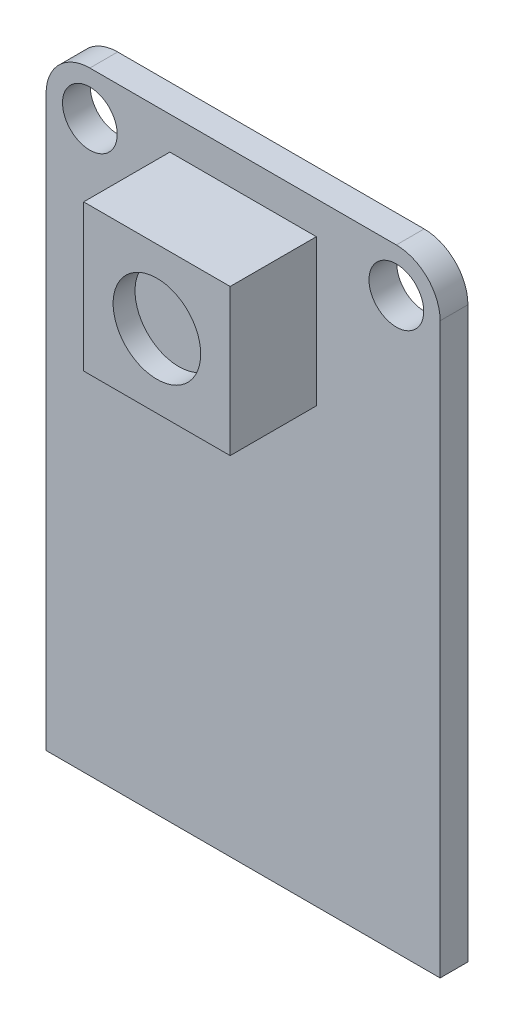
ISO-10303-21;
HEADER;
FILE_DESCRIPTION(('STEP AP214'),'2;1');
FILE_NAME('part.step','',(''),(''),'','','');
FILE_SCHEMA(('AUTOMOTIVE_DESIGN { 1 0 10303 214 1 1 1 1 }'));
ENDSEC;
DATA;
#1=APPLICATION_CONTEXT('core data for automotive mechanical design processes');
#2=APPLICATION_PROTOCOL_DEFINITION('international standard','automotive_design',2000,#1);
#3=PRODUCT_CONTEXT('',#1,'mechanical');
#4=PRODUCT('Part','Part','',(#3));
#5=PRODUCT_RELATED_PRODUCT_CATEGORY('part','',(#4));
#6=PRODUCT_DEFINITION_FORMATION('','',#4);
#7=PRODUCT_DEFINITION_CONTEXT('part definition',#1,'design');
#8=PRODUCT_DEFINITION('design','',#6,#7);
#9=PRODUCT_DEFINITION_SHAPE('','',#8);
#10=(LENGTH_UNIT() NAMED_UNIT(*) SI_UNIT(.MILLI.,.METRE.));
#11=(NAMED_UNIT(*) PLANE_ANGLE_UNIT() SI_UNIT($,.RADIAN.));
#12=(NAMED_UNIT(*) SI_UNIT($,.STERADIAN.) SOLID_ANGLE_UNIT());
#13=UNCERTAINTY_MEASURE_WITH_UNIT(LENGTH_MEASURE(1.E-05),#10,'distance_accuracy_value','');
#14=(GEOMETRIC_REPRESENTATION_CONTEXT(3) GLOBAL_UNCERTAINTY_ASSIGNED_CONTEXT((#13)) GLOBAL_UNIT_ASSIGNED_CONTEXT((#10,
#11,#12)) REPRESENTATION_CONTEXT('',''));
#15=CARTESIAN_POINT('',(0.,0.,0.));
#16=DIRECTION('',(0.,0.,1.));
#17=DIRECTION('',(1.,0.,0.));
#18=AXIS2_PLACEMENT_3D('',#15,#16,#17);
#19=CARTESIAN_POINT('',(0.,0.,1.6129));
#20=DIRECTION('',(0.,0.,-1.));
#21=DIRECTION('',(-1.,0.,0.));
#22=AXIS2_PLACEMENT_3D('',#19,#20,#21);
#23=PLANE('',#22);
#24=CARTESIAN_POINT('',(-8.89,15.24,1.6129));
#25=DIRECTION('',(0.,0.,1.));
#26=DIRECTION('',(1.,0.,0.));
#27=AXIS2_PLACEMENT_3D('',#24,#25,#26);
#28=CIRCLE('',#27,1.5875);
#29=CARTESIAN_POINT('',(-7.3025,15.24,1.6129));
#30=VERTEX_POINT('',#29);
#31=EDGE_CURVE('E390',#30,#30,#28,.T.);
#32=ORIENTED_EDGE('',*,*,#31,.F.);
#33=EDGE_LOOP('',(#32));
#34=FACE_BOUND('',#33,.T.);
#35=CARTESIAN_POINT('',(8.89,15.24,1.6129));
#36=DIRECTION('',(0.,0.,1.));
#37=DIRECTION('',(1.,0.,0.));
#38=AXIS2_PLACEMENT_3D('',#35,#36,#37);
#39=CIRCLE('',#38,1.5875);
#40=CARTESIAN_POINT('',(10.4775,15.24,1.6129));
#41=VERTEX_POINT('',#40);
#42=EDGE_CURVE('E379',#41,#41,#39,.T.);
#43=ORIENTED_EDGE('',*,*,#42,.F.);
#44=EDGE_LOOP('',(#43));
#45=FACE_BOUND('',#44,.T.);
#46=DIRECTION('',(0.,1.,0.));
#47=VECTOR('',#46,1.);
#48=CARTESIAN_POINT('',(11.43,-17.78,1.6129));
#49=LINE('',#48,#47);
#50=CARTESIAN_POINT('',(11.43,-17.78,1.6129));
#51=VERTEX_POINT('',#50);
#52=CARTESIAN_POINT('',(11.43,15.24,1.6129));
#53=VERTEX_POINT('',#52);
#54=EDGE_CURVE('E157',#51,#53,#49,.T.);
#55=ORIENTED_EDGE('',*,*,#54,.T.);
#56=CARTESIAN_POINT('',(8.89,15.24,1.6129));
#57=DIRECTION('',(0.,0.,-1.));
#58=DIRECTION('',(-1.,0.,0.));
#59=AXIS2_PLACEMENT_3D('',#56,#57,#58);
#60=CIRCLE('',#59,2.54);
#61=CARTESIAN_POINT('',(8.89,17.78,1.6129));
#62=VERTEX_POINT('',#61);
#63=EDGE_CURVE('E53',#53,#62,#60,.F.);
#64=ORIENTED_EDGE('',*,*,#63,.T.);
#65=DIRECTION('',(-1.,0.,0.));
#66=VECTOR('',#65,1.);
#67=CARTESIAN_POINT('',(-11.43,17.78,1.6129));
#68=LINE('',#67,#66);
#69=CARTESIAN_POINT('',(-8.89,17.78,1.6129));
#70=VERTEX_POINT('',#69);
#71=EDGE_CURVE('E161',#62,#70,#68,.T.);
#72=ORIENTED_EDGE('',*,*,#71,.T.);
#73=CARTESIAN_POINT('',(-8.89,15.24,1.6129));
#74=DIRECTION('',(0.,0.,-1.));
#75=DIRECTION('',(-1.,0.,0.));
#76=AXIS2_PLACEMENT_3D('',#73,#74,#75);
#77=CIRCLE('',#76,2.54);
#78=CARTESIAN_POINT('',(-11.43,15.24,1.6129));
#79=VERTEX_POINT('',#78);
#80=EDGE_CURVE('E204',#70,#79,#77,.F.);
#81=ORIENTED_EDGE('',*,*,#80,.T.);
#82=DIRECTION('',(0.,-1.,0.));
#83=VECTOR('',#82,1.);
#84=CARTESIAN_POINT('',(-11.43,-17.78,1.6129));
#85=LINE('',#84,#83);
#86=CARTESIAN_POINT('',(-11.43,-17.78,1.6129));
#87=VERTEX_POINT('',#86);
#88=EDGE_CURVE('E166',#79,#87,#85,.T.);
#89=ORIENTED_EDGE('',*,*,#88,.T.);
#90=DIRECTION('',(1.,0.,0.));
#91=VECTOR('',#90,1.);
#92=CARTESIAN_POINT('',(-11.43,-17.78,1.6129));
#93=LINE('',#92,#91);
#94=EDGE_CURVE('E169',#87,#51,#93,.T.);
#95=ORIENTED_EDGE('',*,*,#94,.T.);
#96=EDGE_LOOP('',(#55,#64,#72,#81,#89,#95));
#97=FACE_BOUND('',#96,.T.);
#98=DIRECTION('',(0.,-1.,0.));
#99=VECTOR('',#98,1.);
#100=CARTESIAN_POINT('',(-4.25,15.875,1.6129));
#101=LINE('',#100,#99);
#102=CARTESIAN_POINT('',(-4.25,15.875,1.6129));
#103=VERTEX_POINT('',#102);
#104=CARTESIAN_POINT('',(-4.25,7.375,1.6129));
#105=VERTEX_POINT('',#104);
#106=EDGE_CURVE('E144',#103,#105,#101,.T.);
#107=ORIENTED_EDGE('',*,*,#106,.F.);
#108=DIRECTION('',(-1.,0.,0.));
#109=VECTOR('',#108,1.);
#110=CARTESIAN_POINT('',(-4.25,15.875,1.6129));
#111=LINE('',#110,#109);
#112=CARTESIAN_POINT('',(4.25,15.875,1.6129));
#113=VERTEX_POINT('',#112);
#114=EDGE_CURVE('E141',#113,#103,#111,.T.);
#115=ORIENTED_EDGE('',*,*,#114,.F.);
#116=DIRECTION('',(0.,1.,0.));
#117=VECTOR('',#116,1.);
#118=CARTESIAN_POINT('',(4.25,15.875,1.6129));
#119=LINE('',#118,#117);
#120=CARTESIAN_POINT('',(4.25,7.375,1.6129));
#121=VERTEX_POINT('',#120);
#122=EDGE_CURVE('E65',#121,#113,#119,.T.);
#123=ORIENTED_EDGE('',*,*,#122,.F.);
#124=DIRECTION('',(1.,0.,0.));
#125=VECTOR('',#124,1.);
#126=CARTESIAN_POINT('',(-4.25,7.375,1.6129));
#127=LINE('',#126,#125);
#128=EDGE_CURVE('E60',#105,#121,#127,.T.);
#129=ORIENTED_EDGE('',*,*,#128,.F.);
#130=EDGE_LOOP('',(#107,#115,#123,#129));
#131=FACE_BOUND('',#130,.T.);
#132=ADVANCED_FACE('F44',(#34,#45,#97,#131),#23,.F.);
#133=CARTESIAN_POINT('',(11.43,-17.78,1.6129));
#134=DIRECTION('',(-1.,0.,0.));
#135=DIRECTION('',(0.,0.,1.));
#136=AXIS2_PLACEMENT_3D('',#133,#134,#135);
#137=PLANE('',#136);
#138=DIRECTION('',(0.,1.,0.));
#139=VECTOR('',#138,1.);
#140=CARTESIAN_POINT('',(11.43,-17.78,0.));
#141=LINE('',#140,#139);
#142=CARTESIAN_POINT('',(11.43,-17.78,0.));
#143=VERTEX_POINT('',#142);
#144=CARTESIAN_POINT('',(11.43,15.24,0.));
#145=VERTEX_POINT('',#144);
#146=EDGE_CURVE('E146',#143,#145,#141,.T.);
#147=ORIENTED_EDGE('',*,*,#146,.T.);
#148=DIRECTION('',(0.,0.,-1.));
#149=VECTOR('',#148,1.);
#150=CARTESIAN_POINT('',(11.43,15.24,1.6129));
#151=LINE('',#150,#149);
#152=EDGE_CURVE('E201',#145,#53,#151,.F.);
#153=ORIENTED_EDGE('',*,*,#152,.T.);
#154=ORIENTED_EDGE('',*,*,#54,.F.);
#155=DIRECTION('',(0.,0.,-1.));
#156=VECTOR('',#155,1.);
#157=CARTESIAN_POINT('',(11.43,-17.78,1.6129));
#158=LINE('',#157,#156);
#159=EDGE_CURVE('E171',#51,#143,#158,.T.);
#160=ORIENTED_EDGE('',*,*,#159,.T.);
#161=EDGE_LOOP('',(#147,#153,#154,#160));
#162=FACE_BOUND('',#161,.T.);
#163=ADVANCED_FACE('F225',(#162),#137,.F.);
#164=CARTESIAN_POINT('',(-11.43,17.78,1.6129));
#165=DIRECTION('',(0.,-1.,0.));
#166=DIRECTION('',(0.,0.,-1.));
#167=AXIS2_PLACEMENT_3D('',#164,#165,#166);
#168=PLANE('',#167);
#169=ORIENTED_EDGE('',*,*,#71,.F.);
#170=DIRECTION('',(0.,0.,-1.));
#171=VECTOR('',#170,1.);
#172=CARTESIAN_POINT('',(8.89,17.78,1.6129));
#173=LINE('',#172,#171);
#174=CARTESIAN_POINT('',(8.89,17.78,0.));
#175=VERTEX_POINT('',#174);
#176=EDGE_CURVE('E191',#62,#175,#173,.T.);
#177=ORIENTED_EDGE('',*,*,#176,.T.);
#178=DIRECTION('',(-1.,0.,0.));
#179=VECTOR('',#178,1.);
#180=CARTESIAN_POINT('',(-11.43,17.78,0.));
#181=LINE('',#180,#179);
#182=CARTESIAN_POINT('',(-8.89,17.78,0.));
#183=VERTEX_POINT('',#182);
#184=EDGE_CURVE('E151',#175,#183,#181,.T.);
#185=ORIENTED_EDGE('',*,*,#184,.T.);
#186=DIRECTION('',(0.,0.,-1.));
#187=VECTOR('',#186,1.);
#188=CARTESIAN_POINT('',(-8.89,17.78,1.6129));
#189=LINE('',#188,#187);
#190=EDGE_CURVE('E188',#183,#70,#189,.F.);
#191=ORIENTED_EDGE('',*,*,#190,.T.);
#192=EDGE_LOOP('',(#169,#177,#185,#191));
#193=FACE_BOUND('',#192,.T.);
#194=ADVANCED_FACE('F216',(#193),#168,.F.);
#195=CARTESIAN_POINT('',(-11.43,-17.78,1.6129));
#196=DIRECTION('',(1.,0.,0.));
#197=DIRECTION('',(0.,0.,-1.));
#198=AXIS2_PLACEMENT_3D('',#195,#196,#197);
#199=PLANE('',#198);
#200=ORIENTED_EDGE('',*,*,#88,.F.);
#201=DIRECTION('',(0.,0.,-1.));
#202=VECTOR('',#201,1.);
#203=CARTESIAN_POINT('',(-11.43,15.24,1.6129));
#204=LINE('',#203,#202);
#205=CARTESIAN_POINT('',(-11.43,15.24,0.));
#206=VERTEX_POINT('',#205);
#207=EDGE_CURVE('E11',#79,#206,#204,.T.);
#208=ORIENTED_EDGE('',*,*,#207,.T.);
#209=DIRECTION('',(0.,-1.,0.));
#210=VECTOR('',#209,1.);
#211=CARTESIAN_POINT('',(-11.43,-17.78,0.));
#212=LINE('',#211,#210);
#213=CARTESIAN_POINT('',(-11.43,-17.78,0.));
#214=VERTEX_POINT('',#213);
#215=EDGE_CURVE('E176',#206,#214,#212,.T.);
#216=ORIENTED_EDGE('',*,*,#215,.T.);
#217=DIRECTION('',(0.,0.,-1.));
#218=VECTOR('',#217,1.);
#219=CARTESIAN_POINT('',(-11.43,-17.78,1.6129));
#220=LINE('',#219,#218);
#221=EDGE_CURVE('E184',#87,#214,#220,.T.);
#222=ORIENTED_EDGE('',*,*,#221,.F.);
#223=EDGE_LOOP('',(#200,#208,#216,#222));
#224=FACE_BOUND('',#223,.T.);
#225=ADVANCED_FACE('F234',(#224),#199,.F.);
#226=CARTESIAN_POINT('',(-11.43,-17.78,1.6129));
#227=DIRECTION('',(0.,1.,0.));
#228=DIRECTION('',(0.,0.,1.));
#229=AXIS2_PLACEMENT_3D('',#226,#227,#228);
#230=PLANE('',#229);
#231=DIRECTION('',(1.,0.,0.));
#232=VECTOR('',#231,1.);
#233=CARTESIAN_POINT('',(-11.43,-17.78,0.));
#234=LINE('',#233,#232);
#235=EDGE_CURVE('E162',#214,#143,#234,.T.);
#236=ORIENTED_EDGE('',*,*,#235,.T.);
#237=ORIENTED_EDGE('',*,*,#159,.F.);
#238=ORIENTED_EDGE('',*,*,#94,.F.);
#239=ORIENTED_EDGE('',*,*,#221,.T.);
#240=EDGE_LOOP('',(#236,#237,#238,#239));
#241=FACE_BOUND('',#240,.T.);
#242=ADVANCED_FACE('F229',(#241),#230,.F.);
#243=CARTESIAN_POINT('',(0.,0.,0.));
#244=DIRECTION('',(0.,0.,-1.));
#245=DIRECTION('',(-1.,0.,0.));
#246=AXIS2_PLACEMENT_3D('',#243,#244,#245);
#247=PLANE('',#246);
#248=CARTESIAN_POINT('',(-8.89,15.24,0.));
#249=DIRECTION('',(0.,0.,-1.));
#250=DIRECTION('',(-1.,0.,0.));
#251=AXIS2_PLACEMENT_3D('',#248,#249,#250);
#252=CIRCLE('',#251,1.5875);
#253=CARTESIAN_POINT('',(-10.4775,15.24,0.));
#254=VERTEX_POINT('',#253);
#255=EDGE_CURVE('E394',#254,#254,#252,.F.);
#256=ORIENTED_EDGE('',*,*,#255,.T.);
#257=EDGE_LOOP('',(#256));
#258=FACE_BOUND('',#257,.T.);
#259=CARTESIAN_POINT('',(8.89,15.24,0.));
#260=DIRECTION('',(0.,0.,-1.));
#261=DIRECTION('',(-1.,0.,0.));
#262=AXIS2_PLACEMENT_3D('',#259,#260,#261);
#263=CIRCLE('',#262,1.5875);
#264=CARTESIAN_POINT('',(7.30249999999999,15.24,0.));
#265=VERTEX_POINT('',#264);
#266=EDGE_CURVE('E385',#265,#265,#263,.F.);
#267=ORIENTED_EDGE('',*,*,#266,.T.);
#268=EDGE_LOOP('',(#267));
#269=FACE_BOUND('',#268,.T.);
#270=ORIENTED_EDGE('',*,*,#184,.F.);
#271=CARTESIAN_POINT('',(8.89,15.24,0.));
#272=DIRECTION('',(0.,0.,-1.));
#273=DIRECTION('',(-1.,0.,0.));
#274=AXIS2_PLACEMENT_3D('',#271,#272,#273);
#275=CIRCLE('',#274,2.54);
#276=EDGE_CURVE('E198',#175,#145,#275,.T.);
#277=ORIENTED_EDGE('',*,*,#276,.T.);
#278=ORIENTED_EDGE('',*,*,#146,.F.);
#279=ORIENTED_EDGE('',*,*,#235,.F.);
#280=ORIENTED_EDGE('',*,*,#215,.F.);
#281=CARTESIAN_POINT('',(-8.89,15.24,0.));
#282=DIRECTION('',(0.,0.,-1.));
#283=DIRECTION('',(-1.,0.,0.));
#284=AXIS2_PLACEMENT_3D('',#281,#282,#283);
#285=CIRCLE('',#284,2.54);
#286=EDGE_CURVE('E195',#206,#183,#285,.T.);
#287=ORIENTED_EDGE('',*,*,#286,.T.);
#288=EDGE_LOOP('',(#270,#277,#278,#279,#280,#287));
#289=FACE_BOUND('',#288,.T.);
#290=ADVANCED_FACE('F222',(#258,#269,#289),#247,.T.);
#291=CARTESIAN_POINT('',(8.89,15.24,1.6129));
#292=DIRECTION('',(0.,0.,-1.));
#293=DIRECTION('',(-1.,0.,0.));
#294=AXIS2_PLACEMENT_3D('',#291,#292,#293);
#295=CYLINDRICAL_SURFACE('',#294,2.54);
#296=ORIENTED_EDGE('',*,*,#63,.F.);
#297=ORIENTED_EDGE('',*,*,#152,.F.);
#298=ORIENTED_EDGE('',*,*,#276,.F.);
#299=ORIENTED_EDGE('',*,*,#176,.F.);
#300=EDGE_LOOP('',(#296,#297,#298,#299));
#301=FACE_BOUND('',#300,.T.);
#302=ADVANCED_FACE('F219',(#301),#295,.T.);
#303=CARTESIAN_POINT('',(-8.89,15.24,1.6129));
#304=DIRECTION('',(0.,0.,-1.));
#305=DIRECTION('',(-1.,0.,0.));
#306=AXIS2_PLACEMENT_3D('',#303,#304,#305);
#307=CYLINDRICAL_SURFACE('',#306,2.54);
#308=ORIENTED_EDGE('',*,*,#80,.F.);
#309=ORIENTED_EDGE('',*,*,#190,.F.);
#310=ORIENTED_EDGE('',*,*,#286,.F.);
#311=ORIENTED_EDGE('',*,*,#207,.F.);
#312=EDGE_LOOP('',(#308,#309,#310,#311));
#313=FACE_BOUND('',#312,.T.);
#314=ADVANCED_FACE('F46',(#313),#307,.T.);
#315=CARTESIAN_POINT('',(-4.25,15.875,6.6129));
#316=DIRECTION('',(1.,0.,0.));
#317=DIRECTION('',(0.,1.,0.));
#318=AXIS2_PLACEMENT_3D('',#315,#316,#317);
#319=PLANE('',#318);
#320=ORIENTED_EDGE('',*,*,#106,.T.);
#321=DIRECTION('',(0.,0.,-1.));
#322=VECTOR('',#321,1.);
#323=CARTESIAN_POINT('',(-4.25,7.375,6.6129));
#324=LINE('',#323,#322);
#325=CARTESIAN_POINT('',(-4.25,7.375,6.6129));
#326=VERTEX_POINT('',#325);
#327=EDGE_CURVE('E123',#326,#105,#324,.T.);
#328=ORIENTED_EDGE('',*,*,#327,.F.);
#329=DIRECTION('',(0.,-1.,0.));
#330=VECTOR('',#329,1.);
#331=CARTESIAN_POINT('',(-4.25,15.875,6.6129));
#332=LINE('',#331,#330);
#333=CARTESIAN_POINT('',(-4.25,15.875,6.6129));
#334=VERTEX_POINT('',#333);
#335=EDGE_CURVE('E131',#334,#326,#332,.T.);
#336=ORIENTED_EDGE('',*,*,#335,.F.);
#337=DIRECTION('',(0.,0.,-1.));
#338=VECTOR('',#337,1.);
#339=CARTESIAN_POINT('',(-4.25,15.875,6.6129));
#340=LINE('',#339,#338);
#341=EDGE_CURVE('E405',#334,#103,#340,.T.);
#342=ORIENTED_EDGE('',*,*,#341,.T.);
#343=EDGE_LOOP('',(#320,#328,#336,#342));
#344=FACE_BOUND('',#343,.T.);
#345=ADVANCED_FACE('F143',(#344),#319,.F.);
#346=CARTESIAN_POINT('',(-4.25,7.375,6.6129));
#347=DIRECTION('',(0.,1.,0.));
#348=DIRECTION('',(-1.,0.,0.));
#349=AXIS2_PLACEMENT_3D('',#346,#347,#348);
#350=PLANE('',#349);
#351=ORIENTED_EDGE('',*,*,#128,.T.);
#352=DIRECTION('',(0.,0.,-1.));
#353=VECTOR('',#352,1.);
#354=CARTESIAN_POINT('',(4.25,7.375,6.6129));
#355=LINE('',#354,#353);
#356=CARTESIAN_POINT('',(4.25,7.375,6.6129));
#357=VERTEX_POINT('',#356);
#358=EDGE_CURVE('E126',#357,#121,#355,.T.);
#359=ORIENTED_EDGE('',*,*,#358,.F.);
#360=DIRECTION('',(1.,0.,0.));
#361=VECTOR('',#360,1.);
#362=CARTESIAN_POINT('',(-4.25,7.375,6.6129));
#363=LINE('',#362,#361);
#364=EDGE_CURVE('E119',#326,#357,#363,.T.);
#365=ORIENTED_EDGE('',*,*,#364,.F.);
#366=ORIENTED_EDGE('',*,*,#327,.T.);
#367=EDGE_LOOP('',(#351,#359,#365,#366));
#368=FACE_BOUND('',#367,.T.);
#369=ADVANCED_FACE('F121',(#368),#350,.F.);
#370=CARTESIAN_POINT('',(4.25,15.875,6.6129));
#371=DIRECTION('',(-1.,0.,0.));
#372=DIRECTION('',(0.,-1.,0.));
#373=AXIS2_PLACEMENT_3D('',#370,#371,#372);
#374=PLANE('',#373);
#375=ORIENTED_EDGE('',*,*,#122,.T.);
#376=DIRECTION('',(0.,0.,-1.));
#377=VECTOR('',#376,1.);
#378=CARTESIAN_POINT('',(4.25,15.875,6.6129));
#379=LINE('',#378,#377);
#380=CARTESIAN_POINT('',(4.25,15.875,6.6129));
#381=VERTEX_POINT('',#380);
#382=EDGE_CURVE('E153',#381,#113,#379,.T.);
#383=ORIENTED_EDGE('',*,*,#382,.F.);
#384=DIRECTION('',(0.,1.,0.));
#385=VECTOR('',#384,1.);
#386=CARTESIAN_POINT('',(4.25,15.875,6.6129));
#387=LINE('',#386,#385);
#388=EDGE_CURVE('E130',#357,#381,#387,.T.);
#389=ORIENTED_EDGE('',*,*,#388,.F.);
#390=ORIENTED_EDGE('',*,*,#358,.T.);
#391=EDGE_LOOP('',(#375,#383,#389,#390));
#392=FACE_BOUND('',#391,.T.);
#393=ADVANCED_FACE('F306',(#392),#374,.F.);
#394=CARTESIAN_POINT('',(-4.25,15.875,6.6129));
#395=DIRECTION('',(0.,-1.,0.));
#396=DIRECTION('',(0.,0.,-1.));
#397=AXIS2_PLACEMENT_3D('',#394,#395,#396);
#398=PLANE('',#397);
#399=ORIENTED_EDGE('',*,*,#114,.T.);
#400=ORIENTED_EDGE('',*,*,#341,.F.);
#401=DIRECTION('',(-1.,0.,0.));
#402=VECTOR('',#401,1.);
#403=CARTESIAN_POINT('',(-4.25,15.875,6.6129));
#404=LINE('',#403,#402);
#405=EDGE_CURVE('E136',#381,#334,#404,.T.);
#406=ORIENTED_EDGE('',*,*,#405,.F.);
#407=ORIENTED_EDGE('',*,*,#382,.T.);
#408=EDGE_LOOP('',(#399,#400,#406,#407));
#409=FACE_BOUND('',#408,.T.);
#410=ADVANCED_FACE('F314',(#409),#398,.F.);
#411=CARTESIAN_POINT('',(0.,0.,6.6129));
#412=DIRECTION('',(0.,0.,1.));
#413=DIRECTION('',(1.,0.,0.));
#414=AXIS2_PLACEMENT_3D('',#411,#412,#413);
#415=PLANE('',#414);
#416=CARTESIAN_POINT('',(0.,11.625,6.6129));
#417=DIRECTION('',(0.,0.,1.));
#418=DIRECTION('',(1.,0.,0.));
#419=AXIS2_PLACEMENT_3D('',#416,#417,#418);
#420=CIRCLE('',#419,2.54);
#421=CARTESIAN_POINT('',(2.54,11.625,6.6129));
#422=VERTEX_POINT('',#421);
#423=EDGE_CURVE('E380',#422,#422,#420,.T.);
#424=ORIENTED_EDGE('',*,*,#423,.F.);
#425=EDGE_LOOP('',(#424));
#426=FACE_BOUND('',#425,.T.);
#427=ORIENTED_EDGE('',*,*,#335,.T.);
#428=ORIENTED_EDGE('',*,*,#364,.T.);
#429=ORIENTED_EDGE('',*,*,#388,.T.);
#430=ORIENTED_EDGE('',*,*,#405,.T.);
#431=EDGE_LOOP('',(#427,#428,#429,#430));
#432=FACE_BOUND('',#431,.T.);
#433=ADVANCED_FACE('F134',(#426,#432),#415,.T.);
#434=CARTESIAN_POINT('',(8.89,15.24,-0.000999999999999916));
#435=DIRECTION('',(0.,0.,1.));
#436=DIRECTION('',(1.,0.,0.));
#437=AXIS2_PLACEMENT_3D('',#434,#435,#436);
#438=CYLINDRICAL_SURFACE('',#437,1.5875);
#439=ORIENTED_EDGE('',*,*,#266,.F.);
#440=EDGE_LOOP('',(#439));
#441=FACE_BOUND('',#440,.T.);
#442=ORIENTED_EDGE('',*,*,#42,.T.);
#443=EDGE_LOOP('',(#442));
#444=FACE_BOUND('',#443,.T.);
#445=ADVANCED_FACE('F332',(#441,#444),#438,.F.);
#446=CARTESIAN_POINT('',(-8.89,15.24,-0.000999999999999916));
#447=DIRECTION('',(0.,0.,1.));
#448=DIRECTION('',(1.,0.,0.));
#449=AXIS2_PLACEMENT_3D('',#446,#447,#448);
#450=CYLINDRICAL_SURFACE('',#449,1.5875);
#451=ORIENTED_EDGE('',*,*,#255,.F.);
#452=EDGE_LOOP('',(#451));
#453=FACE_BOUND('',#452,.T.);
#454=ORIENTED_EDGE('',*,*,#31,.T.);
#455=EDGE_LOOP('',(#454));
#456=FACE_BOUND('',#455,.T.);
#457=ADVANCED_FACE('F344',(#453,#456),#450,.F.);
#458=CARTESIAN_POINT('',(0.,11.625,5.3429));
#459=DIRECTION('',(0.,0.,1.));
#460=DIRECTION('',(1.,0.,0.));
#461=AXIS2_PLACEMENT_3D('',#458,#459,#460);
#462=CYLINDRICAL_SURFACE('',#461,2.54);
#463=CARTESIAN_POINT('',(0.,11.625,5.3429));
#464=DIRECTION('',(0.,0.,1.));
#465=DIRECTION('',(1.,0.,0.));
#466=AXIS2_PLACEMENT_3D('',#463,#464,#465);
#467=CIRCLE('',#466,2.54);
#468=CARTESIAN_POINT('',(2.54,11.625,5.3429));
#469=VERTEX_POINT('',#468);
#470=EDGE_CURVE('E377',#469,#469,#467,.T.);
#471=ORIENTED_EDGE('',*,*,#470,.F.);
#472=EDGE_LOOP('',(#471));
#473=FACE_BOUND('',#472,.T.);
#474=ORIENTED_EDGE('',*,*,#423,.T.);
#475=EDGE_LOOP('',(#474));
#476=FACE_BOUND('',#475,.T.);
#477=ADVANCED_FACE('F353',(#473,#476),#462,.F.);
#478=CARTESIAN_POINT('',(0.,11.625,5.3429));
#479=DIRECTION('',(0.,0.,1.));
#480=DIRECTION('',(1.,0.,0.));
#481=AXIS2_PLACEMENT_3D('',#478,#479,#480);
#482=PLANE('',#481);
#483=ORIENTED_EDGE('',*,*,#470,.T.);
#484=EDGE_LOOP('',(#483));
#485=FACE_BOUND('',#484,.T.);
#486=ADVANCED_FACE('F362',(#485),#482,.T.);
#487=CLOSED_SHELL('',(#132,#163,#194,#225,#242,#290,#302,#314,#345,#369,#393,#410,#433,#445,
#457,#477,#486));
#488=MANIFOLD_SOLID_BREP('B2',#487);
#489=ADVANCED_BREP_SHAPE_REPRESENTATION('',(#18,#488),#14);
#490=SHAPE_DEFINITION_REPRESENTATION(#9,#489);
ENDSEC;
END-ISO-10303-21;
